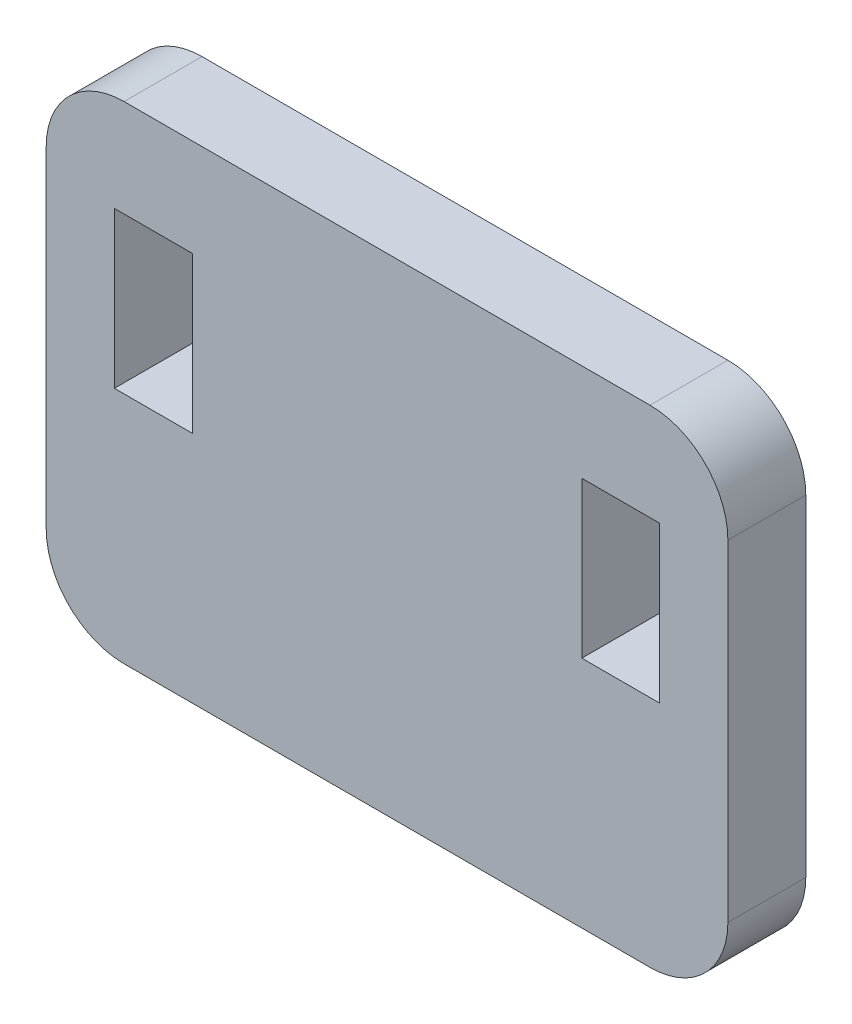
ISO-10303-21;
HEADER;
FILE_DESCRIPTION(('STEP AP214'),'2;1');
FILE_NAME('part.step','',(''),(''),'','','');
FILE_SCHEMA(('AUTOMOTIVE_DESIGN { 1 0 10303 214 1 1 1 1 }'));
ENDSEC;
DATA;
#1=APPLICATION_CONTEXT('core data for automotive mechanical design processes');
#2=APPLICATION_PROTOCOL_DEFINITION('international standard','automotive_design',2000,#1);
#3=PRODUCT_CONTEXT('',#1,'mechanical');
#4=PRODUCT('Part','Part','',(#3));
#5=PRODUCT_RELATED_PRODUCT_CATEGORY('part','',(#4));
#6=PRODUCT_DEFINITION_FORMATION('','',#4);
#7=PRODUCT_DEFINITION_CONTEXT('part definition',#1,'design');
#8=PRODUCT_DEFINITION('design','',#6,#7);
#9=PRODUCT_DEFINITION_SHAPE('','',#8);
#10=(LENGTH_UNIT() NAMED_UNIT(*) SI_UNIT(.MILLI.,.METRE.));
#11=(NAMED_UNIT(*) PLANE_ANGLE_UNIT() SI_UNIT($,.RADIAN.));
#12=(NAMED_UNIT(*) SI_UNIT($,.STERADIAN.) SOLID_ANGLE_UNIT());
#13=UNCERTAINTY_MEASURE_WITH_UNIT(LENGTH_MEASURE(1.E-05),#10,'distance_accuracy_value','');
#14=(GEOMETRIC_REPRESENTATION_CONTEXT(3) GLOBAL_UNCERTAINTY_ASSIGNED_CONTEXT((#13)) GLOBAL_UNIT_ASSIGNED_CONTEXT((#10,
#11,#12)) REPRESENTATION_CONTEXT('',''));
#15=CARTESIAN_POINT('',(0.,0.,0.));
#16=DIRECTION('',(0.,0.,1.));
#17=DIRECTION('',(1.,0.,0.));
#18=AXIS2_PLACEMENT_3D('',#15,#16,#17);
#19=CARTESIAN_POINT('',(31.,4.,4.));
#20=DIRECTION('',(0.,0.,1.));
#21=DIRECTION('',(1.,0.,0.));
#22=AXIS2_PLACEMENT_3D('',#19,#20,#21);
#23=PLANE('',#22);
#24=CARTESIAN_POINT('',(31.,4.,4.));
#25=DIRECTION('',(0.,0.,1.));
#26=DIRECTION('',(1.,0.,0.));
#27=AXIS2_PLACEMENT_3D('',#24,#25,#26);
#28=CIRCLE('',#27,4.);
#29=CARTESIAN_POINT('',(31.,0.,4.));
#30=VERTEX_POINT('',#29);
#31=CARTESIAN_POINT('',(35.,4.00000000000003,4.));
#32=VERTEX_POINT('',#31);
#33=EDGE_CURVE('E214',#30,#32,#28,.T.);
#34=ORIENTED_EDGE('',*,*,#33,.T.);
#35=DIRECTION('',(0.,1.,0.));
#36=VECTOR('',#35,1.);
#37=CARTESIAN_POINT('',(35.,4.00000000000003,4.));
#38=LINE('',#37,#36);
#39=CARTESIAN_POINT('',(35.,21.,4.));
#40=VERTEX_POINT('',#39);
#41=EDGE_CURVE('E217',#32,#40,#38,.T.);
#42=ORIENTED_EDGE('',*,*,#41,.T.);
#43=CARTESIAN_POINT('',(31.,21.,4.));
#44=DIRECTION('',(0.,0.,1.));
#45=DIRECTION('',(-1.,0.,0.));
#46=AXIS2_PLACEMENT_3D('',#43,#44,#45);
#47=CIRCLE('',#46,4.);
#48=CARTESIAN_POINT('',(31.,25.,4.));
#49=VERTEX_POINT('',#48);
#50=EDGE_CURVE('E220',#40,#49,#47,.T.);
#51=ORIENTED_EDGE('',*,*,#50,.T.);
#52=DIRECTION('',(-1.,0.,0.));
#53=VECTOR('',#52,1.);
#54=CARTESIAN_POINT('',(4.,25.,4.));
#55=LINE('',#54,#53);
#56=CARTESIAN_POINT('',(4.,25.,4.));
#57=VERTEX_POINT('',#56);
#58=EDGE_CURVE('E222',#49,#57,#55,.T.);
#59=ORIENTED_EDGE('',*,*,#58,.T.);
#60=CARTESIAN_POINT('',(4.,21.,4.));
#61=DIRECTION('',(0.,0.,1.));
#62=DIRECTION('',(-1.,0.,0.));
#63=AXIS2_PLACEMENT_3D('',#60,#61,#62);
#64=CIRCLE('',#63,4.);
#65=CARTESIAN_POINT('',(0.,21.,4.));
#66=VERTEX_POINT('',#65);
#67=EDGE_CURVE('E224',#57,#66,#64,.T.);
#68=ORIENTED_EDGE('',*,*,#67,.T.);
#69=DIRECTION('',(0.,-1.,0.));
#70=VECTOR('',#69,1.);
#71=CARTESIAN_POINT('',(0.,4.00000000000003,4.));
#72=LINE('',#71,#70);
#73=CARTESIAN_POINT('',(0.,4.,4.));
#74=VERTEX_POINT('',#73);
#75=EDGE_CURVE('E226',#66,#74,#72,.T.);
#76=ORIENTED_EDGE('',*,*,#75,.T.);
#77=CARTESIAN_POINT('',(4.,4.,4.));
#78=DIRECTION('',(0.,0.,1.));
#79=DIRECTION('',(-1.,0.,0.));
#80=AXIS2_PLACEMENT_3D('',#77,#78,#79);
#81=CIRCLE('',#80,4.);
#82=CARTESIAN_POINT('',(4.00000000000003,0.,4.));
#83=VERTEX_POINT('',#82);
#84=EDGE_CURVE('E228',#74,#83,#81,.T.);
#85=ORIENTED_EDGE('',*,*,#84,.T.);
#86=DIRECTION('',(1.,0.,0.));
#87=VECTOR('',#86,1.);
#88=CARTESIAN_POINT('',(4.00000000000003,0.,4.));
#89=LINE('',#88,#87);
#90=EDGE_CURVE('E230',#83,#30,#89,.T.);
#91=ORIENTED_EDGE('',*,*,#90,.T.);
#92=EDGE_LOOP('',(#34,#42,#51,#59,#68,#76,#85,#91));
#93=FACE_BOUND('',#92,.T.);
#94=DIRECTION('',(1.,0.,0.));
#95=VECTOR('',#94,1.);
#96=CARTESIAN_POINT('',(3.5,12.,4.));
#97=LINE('',#96,#95);
#98=CARTESIAN_POINT('',(3.5,12.,4.));
#99=VERTEX_POINT('',#98);
#100=CARTESIAN_POINT('',(7.5,12.,4.));
#101=VERTEX_POINT('',#100);
#102=EDGE_CURVE('E185',#99,#101,#97,.T.);
#103=ORIENTED_EDGE('',*,*,#102,.F.);
#104=DIRECTION('',(0.,-1.,0.));
#105=VECTOR('',#104,1.);
#106=CARTESIAN_POINT('',(3.5,20.,4.));
#107=LINE('',#106,#105);
#108=CARTESIAN_POINT('',(3.5,20.,4.));
#109=VERTEX_POINT('',#108);
#110=EDGE_CURVE('E183',#109,#99,#107,.T.);
#111=ORIENTED_EDGE('',*,*,#110,.F.);
#112=DIRECTION('',(-1.,0.,0.));
#113=VECTOR('',#112,1.);
#114=CARTESIAN_POINT('',(3.5,20.,4.));
#115=LINE('',#114,#113);
#116=CARTESIAN_POINT('',(7.5,20.,4.));
#117=VERTEX_POINT('',#116);
#118=EDGE_CURVE('E191',#117,#109,#115,.T.);
#119=ORIENTED_EDGE('',*,*,#118,.F.);
#120=DIRECTION('',(0.,1.,0.));
#121=VECTOR('',#120,1.);
#122=CARTESIAN_POINT('',(7.5,20.,4.));
#123=LINE('',#122,#121);
#124=EDGE_CURVE('E188',#101,#117,#123,.T.);
#125=ORIENTED_EDGE('',*,*,#124,.F.);
#126=EDGE_LOOP('',(#103,#111,#119,#125));
#127=FACE_BOUND('',#126,.T.);
#128=DIRECTION('',(-1.,0.,0.));
#129=VECTOR('',#128,1.);
#130=CARTESIAN_POINT('',(31.5,20.,4.));
#131=LINE('',#130,#129);
#132=CARTESIAN_POINT('',(31.5,20.,4.));
#133=VERTEX_POINT('',#132);
#134=CARTESIAN_POINT('',(27.5,20.,4.));
#135=VERTEX_POINT('',#134);
#136=EDGE_CURVE('E155',#133,#135,#131,.T.);
#137=ORIENTED_EDGE('',*,*,#136,.F.);
#138=DIRECTION('',(0.,1.,0.));
#139=VECTOR('',#138,1.);
#140=CARTESIAN_POINT('',(31.5,20.,4.));
#141=LINE('',#140,#139);
#142=CARTESIAN_POINT('',(31.5,12.,4.));
#143=VERTEX_POINT('',#142);
#144=EDGE_CURVE('E147',#143,#133,#141,.T.);
#145=ORIENTED_EDGE('',*,*,#144,.F.);
#146=DIRECTION('',(1.,0.,0.));
#147=VECTOR('',#146,1.);
#148=CARTESIAN_POINT('',(31.5,12.,4.));
#149=LINE('',#148,#147);
#150=CARTESIAN_POINT('',(27.5,12.,4.));
#151=VERTEX_POINT('',#150);
#152=EDGE_CURVE('E169',#151,#143,#149,.T.);
#153=ORIENTED_EDGE('',*,*,#152,.F.);
#154=DIRECTION('',(0.,-1.,0.));
#155=VECTOR('',#154,1.);
#156=CARTESIAN_POINT('',(27.5,20.,4.));
#157=LINE('',#156,#155);
#158=EDGE_CURVE('E167',#135,#151,#157,.T.);
#159=ORIENTED_EDGE('',*,*,#158,.F.);
#160=EDGE_LOOP('',(#137,#145,#153,#159));
#161=FACE_BOUND('',#160,.T.);
#162=ADVANCED_FACE('F34',(#93,#127,#161),#23,.T.);
#163=CARTESIAN_POINT('',(31.,4.,0.));
#164=DIRECTION('',(0.,0.,1.));
#165=DIRECTION('',(1.,0.,0.));
#166=AXIS2_PLACEMENT_3D('',#163,#164,#165);
#167=PLANE('',#166);
#168=DIRECTION('',(0.,-1.,0.));
#169=VECTOR('',#168,1.);
#170=CARTESIAN_POINT('',(3.5,20.,0.));
#171=LINE('',#170,#169);
#172=CARTESIAN_POINT('',(3.5,20.,0.));
#173=VERTEX_POINT('',#172);
#174=CARTESIAN_POINT('',(3.5,12.,0.));
#175=VERTEX_POINT('',#174);
#176=EDGE_CURVE('E163',#173,#175,#171,.T.);
#177=ORIENTED_EDGE('',*,*,#176,.T.);
#178=DIRECTION('',(1.,0.,0.));
#179=VECTOR('',#178,1.);
#180=CARTESIAN_POINT('',(3.5,12.,0.));
#181=LINE('',#180,#179);
#182=CARTESIAN_POINT('',(7.5,12.,0.));
#183=VERTEX_POINT('',#182);
#184=EDGE_CURVE('E196',#175,#183,#181,.T.);
#185=ORIENTED_EDGE('',*,*,#184,.T.);
#186=DIRECTION('',(0.,1.,0.));
#187=VECTOR('',#186,1.);
#188=CARTESIAN_POINT('',(7.5,20.,0.));
#189=LINE('',#188,#187);
#190=CARTESIAN_POINT('',(7.5,20.,0.));
#191=VERTEX_POINT('',#190);
#192=EDGE_CURVE('E199',#183,#191,#189,.T.);
#193=ORIENTED_EDGE('',*,*,#192,.T.);
#194=DIRECTION('',(-1.,0.,0.));
#195=VECTOR('',#194,1.);
#196=CARTESIAN_POINT('',(3.5,20.,0.));
#197=LINE('',#196,#195);
#198=EDGE_CURVE('E186',#191,#173,#197,.T.);
#199=ORIENTED_EDGE('',*,*,#198,.T.);
#200=EDGE_LOOP('',(#177,#185,#193,#199));
#201=FACE_BOUND('',#200,.T.);
#202=CARTESIAN_POINT('',(31.,4.,0.));
#203=DIRECTION('',(0.,0.,1.));
#204=DIRECTION('',(1.,0.,0.));
#205=AXIS2_PLACEMENT_3D('',#202,#203,#204);
#206=CIRCLE('',#205,4.);
#207=CARTESIAN_POINT('',(31.,0.,0.));
#208=VERTEX_POINT('',#207);
#209=CARTESIAN_POINT('',(35.,4.00000000000003,0.));
#210=VERTEX_POINT('',#209);
#211=EDGE_CURVE('E213',#208,#210,#206,.T.);
#212=ORIENTED_EDGE('',*,*,#211,.F.);
#213=DIRECTION('',(1.,0.,0.));
#214=VECTOR('',#213,1.);
#215=CARTESIAN_POINT('',(4.00000000000003,0.,0.));
#216=LINE('',#215,#214);
#217=CARTESIAN_POINT('',(4.00000000000003,0.,0.));
#218=VERTEX_POINT('',#217);
#219=EDGE_CURVE('E218',#218,#208,#216,.T.);
#220=ORIENTED_EDGE('',*,*,#219,.F.);
#221=CARTESIAN_POINT('',(4.,4.,0.));
#222=DIRECTION('',(0.,0.,1.));
#223=DIRECTION('',(-1.,0.,0.));
#224=AXIS2_PLACEMENT_3D('',#221,#222,#223);
#225=CIRCLE('',#224,4.);
#226=CARTESIAN_POINT('',(0.,4.,0.));
#227=VERTEX_POINT('',#226);
#228=EDGE_CURVE('E245',#227,#218,#225,.T.);
#229=ORIENTED_EDGE('',*,*,#228,.F.);
#230=DIRECTION('',(0.,-1.,0.));
#231=VECTOR('',#230,1.);
#232=CARTESIAN_POINT('',(0.,4.00000000000003,0.));
#233=LINE('',#232,#231);
#234=CARTESIAN_POINT('',(0.,21.,0.));
#235=VERTEX_POINT('',#234);
#236=EDGE_CURVE('E243',#235,#227,#233,.T.);
#237=ORIENTED_EDGE('',*,*,#236,.F.);
#238=CARTESIAN_POINT('',(4.,21.,0.));
#239=DIRECTION('',(0.,0.,1.));
#240=DIRECTION('',(-1.,0.,0.));
#241=AXIS2_PLACEMENT_3D('',#238,#239,#240);
#242=CIRCLE('',#241,4.);
#243=CARTESIAN_POINT('',(4.,25.,0.));
#244=VERTEX_POINT('',#243);
#245=EDGE_CURVE('E241',#244,#235,#242,.T.);
#246=ORIENTED_EDGE('',*,*,#245,.F.);
#247=DIRECTION('',(-1.,0.,0.));
#248=VECTOR('',#247,1.);
#249=CARTESIAN_POINT('',(4.,25.,0.));
#250=LINE('',#249,#248);
#251=CARTESIAN_POINT('',(31.,25.,0.));
#252=VERTEX_POINT('',#251);
#253=EDGE_CURVE('E239',#252,#244,#250,.T.);
#254=ORIENTED_EDGE('',*,*,#253,.F.);
#255=CARTESIAN_POINT('',(31.,21.,0.));
#256=DIRECTION('',(0.,0.,1.));
#257=DIRECTION('',(-1.,0.,0.));
#258=AXIS2_PLACEMENT_3D('',#255,#256,#257);
#259=CIRCLE('',#258,4.);
#260=CARTESIAN_POINT('',(35.,21.,0.));
#261=VERTEX_POINT('',#260);
#262=EDGE_CURVE('E237',#261,#252,#259,.T.);
#263=ORIENTED_EDGE('',*,*,#262,.F.);
#264=DIRECTION('',(0.,1.,0.));
#265=VECTOR('',#264,1.);
#266=CARTESIAN_POINT('',(35.,4.00000000000003,0.));
#267=LINE('',#266,#265);
#268=EDGE_CURVE('E235',#210,#261,#267,.T.);
#269=ORIENTED_EDGE('',*,*,#268,.F.);
#270=EDGE_LOOP('',(#212,#220,#229,#237,#246,#254,#263,#269));
#271=FACE_BOUND('',#270,.T.);
#272=DIRECTION('',(0.,1.,0.));
#273=VECTOR('',#272,1.);
#274=CARTESIAN_POINT('',(31.5,20.,0.));
#275=LINE('',#274,#273);
#276=CARTESIAN_POINT('',(31.5,12.,0.));
#277=VERTEX_POINT('',#276);
#278=CARTESIAN_POINT('',(31.5,20.,0.));
#279=VERTEX_POINT('',#278);
#280=EDGE_CURVE('E57',#277,#279,#275,.T.);
#281=ORIENTED_EDGE('',*,*,#280,.T.);
#282=DIRECTION('',(-1.,0.,0.));
#283=VECTOR('',#282,1.);
#284=CARTESIAN_POINT('',(31.5,20.,0.));
#285=LINE('',#284,#283);
#286=CARTESIAN_POINT('',(27.5,20.,0.));
#287=VERTEX_POINT('',#286);
#288=EDGE_CURVE('E162',#279,#287,#285,.T.);
#289=ORIENTED_EDGE('',*,*,#288,.T.);
#290=DIRECTION('',(0.,-1.,0.));
#291=VECTOR('',#290,1.);
#292=CARTESIAN_POINT('',(27.5,20.,0.));
#293=LINE('',#292,#291);
#294=CARTESIAN_POINT('',(27.5,12.,0.));
#295=VERTEX_POINT('',#294);
#296=EDGE_CURVE('E175',#287,#295,#293,.T.);
#297=ORIENTED_EDGE('',*,*,#296,.T.);
#298=DIRECTION('',(1.,0.,0.));
#299=VECTOR('',#298,1.);
#300=CARTESIAN_POINT('',(31.5,12.,0.));
#301=LINE('',#300,#299);
#302=EDGE_CURVE('E156',#295,#277,#301,.T.);
#303=ORIENTED_EDGE('',*,*,#302,.T.);
#304=EDGE_LOOP('',(#281,#289,#297,#303));
#305=FACE_BOUND('',#304,.T.);
#306=ADVANCED_FACE('F275',(#201,#271,#305),#167,.F.);
#307=CARTESIAN_POINT('',(31.,4.,4.));
#308=DIRECTION('',(0.,0.,-1.));
#309=DIRECTION('',(-1.,0.,0.));
#310=AXIS2_PLACEMENT_3D('',#307,#308,#309);
#311=CYLINDRICAL_SURFACE('',#310,4.);
#312=ORIENTED_EDGE('',*,*,#211,.T.);
#313=DIRECTION('',(0.,0.,-1.));
#314=VECTOR('',#313,1.);
#315=CARTESIAN_POINT('',(35.,4.00000000000003,4.));
#316=LINE('',#315,#314);
#317=EDGE_CURVE('E11',#32,#210,#316,.T.);
#318=ORIENTED_EDGE('',*,*,#317,.F.);
#319=ORIENTED_EDGE('',*,*,#33,.F.);
#320=DIRECTION('',(0.,0.,-1.));
#321=VECTOR('',#320,1.);
#322=CARTESIAN_POINT('',(31.,0.,4.));
#323=LINE('',#322,#321);
#324=EDGE_CURVE('E232',#30,#208,#323,.T.);
#325=ORIENTED_EDGE('',*,*,#324,.T.);
#326=EDGE_LOOP('',(#312,#318,#319,#325));
#327=FACE_BOUND('',#326,.T.);
#328=ADVANCED_FACE('F36',(#327),#311,.T.);
#329=CARTESIAN_POINT('',(35.,4.00000000000003,4.));
#330=DIRECTION('',(-1.,0.,0.));
#331=DIRECTION('',(0.,0.,1.));
#332=AXIS2_PLACEMENT_3D('',#329,#330,#331);
#333=PLANE('',#332);
#334=ORIENTED_EDGE('',*,*,#268,.T.);
#335=DIRECTION('',(0.,0.,-1.));
#336=VECTOR('',#335,1.);
#337=CARTESIAN_POINT('',(35.,21.,4.));
#338=LINE('',#337,#336);
#339=EDGE_CURVE('E42',#40,#261,#338,.T.);
#340=ORIENTED_EDGE('',*,*,#339,.F.);
#341=ORIENTED_EDGE('',*,*,#41,.F.);
#342=ORIENTED_EDGE('',*,*,#317,.T.);
#343=EDGE_LOOP('',(#334,#340,#341,#342));
#344=FACE_BOUND('',#343,.T.);
#345=ADVANCED_FACE('F293',(#344),#333,.F.);
#346=CARTESIAN_POINT('',(31.,21.,4.));
#347=DIRECTION('',(0.,0.,-1.));
#348=DIRECTION('',(-1.,0.,0.));
#349=AXIS2_PLACEMENT_3D('',#346,#347,#348);
#350=CYLINDRICAL_SURFACE('',#349,4.);
#351=ORIENTED_EDGE('',*,*,#262,.T.);
#352=DIRECTION('',(0.,0.,-1.));
#353=VECTOR('',#352,1.);
#354=CARTESIAN_POINT('',(31.,25.,4.));
#355=LINE('',#354,#353);
#356=EDGE_CURVE('E262',#49,#252,#355,.T.);
#357=ORIENTED_EDGE('',*,*,#356,.F.);
#358=ORIENTED_EDGE('',*,*,#50,.F.);
#359=ORIENTED_EDGE('',*,*,#339,.T.);
#360=EDGE_LOOP('',(#351,#357,#358,#359));
#361=FACE_BOUND('',#360,.T.);
#362=ADVANCED_FACE('F269',(#361),#350,.T.);
#363=CARTESIAN_POINT('',(4.,25.,4.));
#364=DIRECTION('',(0.,-1.,0.));
#365=DIRECTION('',(1.,0.,0.));
#366=AXIS2_PLACEMENT_3D('',#363,#364,#365);
#367=PLANE('',#366);
#368=ORIENTED_EDGE('',*,*,#253,.T.);
#369=DIRECTION('',(0.,0.,-1.));
#370=VECTOR('',#369,1.);
#371=CARTESIAN_POINT('',(4.,25.,4.));
#372=LINE('',#371,#370);
#373=EDGE_CURVE('E259',#57,#244,#372,.T.);
#374=ORIENTED_EDGE('',*,*,#373,.F.);
#375=ORIENTED_EDGE('',*,*,#58,.F.);
#376=ORIENTED_EDGE('',*,*,#356,.T.);
#377=EDGE_LOOP('',(#368,#374,#375,#376));
#378=FACE_BOUND('',#377,.T.);
#379=ADVANCED_FACE('F281',(#378),#367,.F.);
#380=CARTESIAN_POINT('',(4.,21.,4.));
#381=DIRECTION('',(0.,0.,-1.));
#382=DIRECTION('',(-1.,0.,0.));
#383=AXIS2_PLACEMENT_3D('',#380,#381,#382);
#384=CYLINDRICAL_SURFACE('',#383,4.);
#385=ORIENTED_EDGE('',*,*,#245,.T.);
#386=DIRECTION('',(0.,0.,-1.));
#387=VECTOR('',#386,1.);
#388=CARTESIAN_POINT('',(0.,21.,4.));
#389=LINE('',#388,#387);
#390=EDGE_CURVE('E256',#66,#235,#389,.T.);
#391=ORIENTED_EDGE('',*,*,#390,.F.);
#392=ORIENTED_EDGE('',*,*,#67,.F.);
#393=ORIENTED_EDGE('',*,*,#373,.T.);
#394=EDGE_LOOP('',(#385,#391,#392,#393));
#395=FACE_BOUND('',#394,.T.);
#396=ADVANCED_FACE('F285',(#395),#384,.T.);
#397=CARTESIAN_POINT('',(0.,4.00000000000003,4.));
#398=DIRECTION('',(1.,0.,0.));
#399=DIRECTION('',(0.,0.,-1.));
#400=AXIS2_PLACEMENT_3D('',#397,#398,#399);
#401=PLANE('',#400);
#402=ORIENTED_EDGE('',*,*,#236,.T.);
#403=DIRECTION('',(0.,0.,-1.));
#404=VECTOR('',#403,1.);
#405=CARTESIAN_POINT('',(0.,4.,4.));
#406=LINE('',#405,#404);
#407=EDGE_CURVE('E253',#74,#227,#406,.T.);
#408=ORIENTED_EDGE('',*,*,#407,.F.);
#409=ORIENTED_EDGE('',*,*,#75,.F.);
#410=ORIENTED_EDGE('',*,*,#390,.T.);
#411=EDGE_LOOP('',(#402,#408,#409,#410));
#412=FACE_BOUND('',#411,.T.);
#413=ADVANCED_FACE('F306',(#412),#401,.F.);
#414=CARTESIAN_POINT('',(4.,4.,4.));
#415=DIRECTION('',(0.,0.,-1.));
#416=DIRECTION('',(-1.,0.,0.));
#417=AXIS2_PLACEMENT_3D('',#414,#415,#416);
#418=CYLINDRICAL_SURFACE('',#417,4.);
#419=ORIENTED_EDGE('',*,*,#228,.T.);
#420=DIRECTION('',(0.,0.,-1.));
#421=VECTOR('',#420,1.);
#422=CARTESIAN_POINT('',(4.00000000000003,0.,4.));
#423=LINE('',#422,#421);
#424=EDGE_CURVE('E250',#83,#218,#423,.T.);
#425=ORIENTED_EDGE('',*,*,#424,.F.);
#426=ORIENTED_EDGE('',*,*,#84,.F.);
#427=ORIENTED_EDGE('',*,*,#407,.T.);
#428=EDGE_LOOP('',(#419,#425,#426,#427));
#429=FACE_BOUND('',#428,.T.);
#430=ADVANCED_FACE('F304',(#429),#418,.T.);
#431=CARTESIAN_POINT('',(4.00000000000003,0.,4.));
#432=DIRECTION('',(0.,1.,0.));
#433=DIRECTION('',(0.,0.,1.));
#434=AXIS2_PLACEMENT_3D('',#431,#432,#433);
#435=PLANE('',#434);
#436=ORIENTED_EDGE('',*,*,#219,.T.);
#437=ORIENTED_EDGE('',*,*,#324,.F.);
#438=ORIENTED_EDGE('',*,*,#90,.F.);
#439=ORIENTED_EDGE('',*,*,#424,.T.);
#440=EDGE_LOOP('',(#436,#437,#438,#439));
#441=FACE_BOUND('',#440,.T.);
#442=ADVANCED_FACE('F299',(#441),#435,.F.);
#443=CARTESIAN_POINT('',(3.5,20.,4.));
#444=DIRECTION('',(1.,0.,0.));
#445=DIRECTION('',(0.,1.,0.));
#446=AXIS2_PLACEMENT_3D('',#443,#444,#445);
#447=PLANE('',#446);
#448=ORIENTED_EDGE('',*,*,#176,.F.);
#449=DIRECTION('',(0.,0.,-1.));
#450=VECTOR('',#449,1.);
#451=CARTESIAN_POINT('',(3.5,20.,4.));
#452=LINE('',#451,#450);
#453=EDGE_CURVE('E193',#109,#173,#452,.T.);
#454=ORIENTED_EDGE('',*,*,#453,.F.);
#455=ORIENTED_EDGE('',*,*,#110,.T.);
#456=DIRECTION('',(0.,0.,-1.));
#457=VECTOR('',#456,1.);
#458=CARTESIAN_POINT('',(3.5,12.,4.));
#459=LINE('',#458,#457);
#460=EDGE_CURVE('E210',#99,#175,#459,.T.);
#461=ORIENTED_EDGE('',*,*,#460,.T.);
#462=EDGE_LOOP('',(#448,#454,#455,#461));
#463=FACE_BOUND('',#462,.T.);
#464=ADVANCED_FACE('F323',(#463),#447,.T.);
#465=CARTESIAN_POINT('',(3.5,12.,4.));
#466=DIRECTION('',(0.,1.,0.));
#467=DIRECTION('',(0.,0.,1.));
#468=AXIS2_PLACEMENT_3D('',#465,#466,#467);
#469=PLANE('',#468);
#470=ORIENTED_EDGE('',*,*,#184,.F.);
#471=ORIENTED_EDGE('',*,*,#460,.F.);
#472=ORIENTED_EDGE('',*,*,#102,.T.);
#473=DIRECTION('',(0.,0.,-1.));
#474=VECTOR('',#473,1.);
#475=CARTESIAN_POINT('',(7.5,12.,4.));
#476=LINE('',#475,#474);
#477=EDGE_CURVE('E208',#101,#183,#476,.T.);
#478=ORIENTED_EDGE('',*,*,#477,.T.);
#479=EDGE_LOOP('',(#470,#471,#472,#478));
#480=FACE_BOUND('',#479,.T.);
#481=ADVANCED_FACE('F330',(#480),#469,.T.);
#482=CARTESIAN_POINT('',(7.5,20.,4.));
#483=DIRECTION('',(-1.,0.,0.));
#484=DIRECTION('',(0.,0.,1.));
#485=AXIS2_PLACEMENT_3D('',#482,#483,#484);
#486=PLANE('',#485);
#487=ORIENTED_EDGE('',*,*,#192,.F.);
#488=ORIENTED_EDGE('',*,*,#477,.F.);
#489=ORIENTED_EDGE('',*,*,#124,.T.);
#490=DIRECTION('',(0.,0.,-1.));
#491=VECTOR('',#490,1.);
#492=CARTESIAN_POINT('',(7.5,20.,4.));
#493=LINE('',#492,#491);
#494=EDGE_CURVE('E206',#117,#191,#493,.T.);
#495=ORIENTED_EDGE('',*,*,#494,.T.);
#496=EDGE_LOOP('',(#487,#488,#489,#495));
#497=FACE_BOUND('',#496,.T.);
#498=ADVANCED_FACE('F335',(#497),#486,.T.);
#499=CARTESIAN_POINT('',(3.5,20.,4.));
#500=DIRECTION('',(0.,-1.,0.));
#501=DIRECTION('',(0.,0.,-1.));
#502=AXIS2_PLACEMENT_3D('',#499,#500,#501);
#503=PLANE('',#502);
#504=ORIENTED_EDGE('',*,*,#198,.F.);
#505=ORIENTED_EDGE('',*,*,#494,.F.);
#506=ORIENTED_EDGE('',*,*,#118,.T.);
#507=ORIENTED_EDGE('',*,*,#453,.T.);
#508=EDGE_LOOP('',(#504,#505,#506,#507));
#509=FACE_BOUND('',#508,.T.);
#510=ADVANCED_FACE('F342',(#509),#503,.T.);
#511=CARTESIAN_POINT('',(31.5,20.,4.));
#512=DIRECTION('',(-1.,0.,0.));
#513=DIRECTION('',(0.,-1.,0.));
#514=AXIS2_PLACEMENT_3D('',#511,#512,#513);
#515=PLANE('',#514);
#516=ORIENTED_EDGE('',*,*,#280,.F.);
#517=DIRECTION('',(0.,0.,-1.));
#518=VECTOR('',#517,1.);
#519=CARTESIAN_POINT('',(31.5,12.,4.));
#520=LINE('',#519,#518);
#521=EDGE_CURVE('E151',#143,#277,#520,.T.);
#522=ORIENTED_EDGE('',*,*,#521,.F.);
#523=ORIENTED_EDGE('',*,*,#144,.T.);
#524=DIRECTION('',(0.,0.,-1.));
#525=VECTOR('',#524,1.);
#526=CARTESIAN_POINT('',(31.5,20.,4.));
#527=LINE('',#526,#525);
#528=EDGE_CURVE('E150',#133,#279,#527,.T.);
#529=ORIENTED_EDGE('',*,*,#528,.T.);
#530=EDGE_LOOP('',(#516,#522,#523,#529));
#531=FACE_BOUND('',#530,.T.);
#532=ADVANCED_FACE('F149',(#531),#515,.T.);
#533=CARTESIAN_POINT('',(31.5,20.,4.));
#534=DIRECTION('',(0.,-1.,0.));
#535=DIRECTION('',(0.,0.,-1.));
#536=AXIS2_PLACEMENT_3D('',#533,#534,#535);
#537=PLANE('',#536);
#538=ORIENTED_EDGE('',*,*,#288,.F.);
#539=ORIENTED_EDGE('',*,*,#528,.F.);
#540=ORIENTED_EDGE('',*,*,#136,.T.);
#541=DIRECTION('',(0.,0.,-1.));
#542=VECTOR('',#541,1.);
#543=CARTESIAN_POINT('',(27.5,20.,4.));
#544=LINE('',#543,#542);
#545=EDGE_CURVE('E164',#135,#287,#544,.T.);
#546=ORIENTED_EDGE('',*,*,#545,.T.);
#547=EDGE_LOOP('',(#538,#539,#540,#546));
#548=FACE_BOUND('',#547,.T.);
#549=ADVANCED_FACE('F159',(#548),#537,.T.);
#550=CARTESIAN_POINT('',(27.5,20.,4.));
#551=DIRECTION('',(1.,0.,0.));
#552=DIRECTION('',(0.,0.,-1.));
#553=AXIS2_PLACEMENT_3D('',#550,#551,#552);
#554=PLANE('',#553);
#555=ORIENTED_EDGE('',*,*,#296,.F.);
#556=ORIENTED_EDGE('',*,*,#545,.F.);
#557=ORIENTED_EDGE('',*,*,#158,.T.);
#558=DIRECTION('',(0.,0.,-1.));
#559=VECTOR('',#558,1.);
#560=CARTESIAN_POINT('',(27.5,12.,4.));
#561=LINE('',#560,#559);
#562=EDGE_CURVE('E49',#151,#295,#561,.T.);
#563=ORIENTED_EDGE('',*,*,#562,.T.);
#564=EDGE_LOOP('',(#555,#556,#557,#563));
#565=FACE_BOUND('',#564,.T.);
#566=ADVANCED_FACE('F360',(#565),#554,.T.);
#567=CARTESIAN_POINT('',(31.5,12.,4.));
#568=DIRECTION('',(0.,1.,0.));
#569=DIRECTION('',(-1.,0.,0.));
#570=AXIS2_PLACEMENT_3D('',#567,#568,#569);
#571=PLANE('',#570);
#572=ORIENTED_EDGE('',*,*,#302,.F.);
#573=ORIENTED_EDGE('',*,*,#562,.F.);
#574=ORIENTED_EDGE('',*,*,#152,.T.);
#575=ORIENTED_EDGE('',*,*,#521,.T.);
#576=EDGE_LOOP('',(#572,#573,#574,#575));
#577=FACE_BOUND('',#576,.T.);
#578=ADVANCED_FACE('F363',(#577),#571,.T.);
#579=CLOSED_SHELL('',(#162,#306,#328,#345,#362,#379,#396,#413,#430,#442,#464,#481,#498,#510,
#532,#549,#566,#578));
#580=MANIFOLD_SOLID_BREP('B2',#579);
#581=ADVANCED_BREP_SHAPE_REPRESENTATION('',(#18,#580),#14);
#582=SHAPE_DEFINITION_REPRESENTATION(#9,#581);
ENDSEC;
END-ISO-10303-21;
